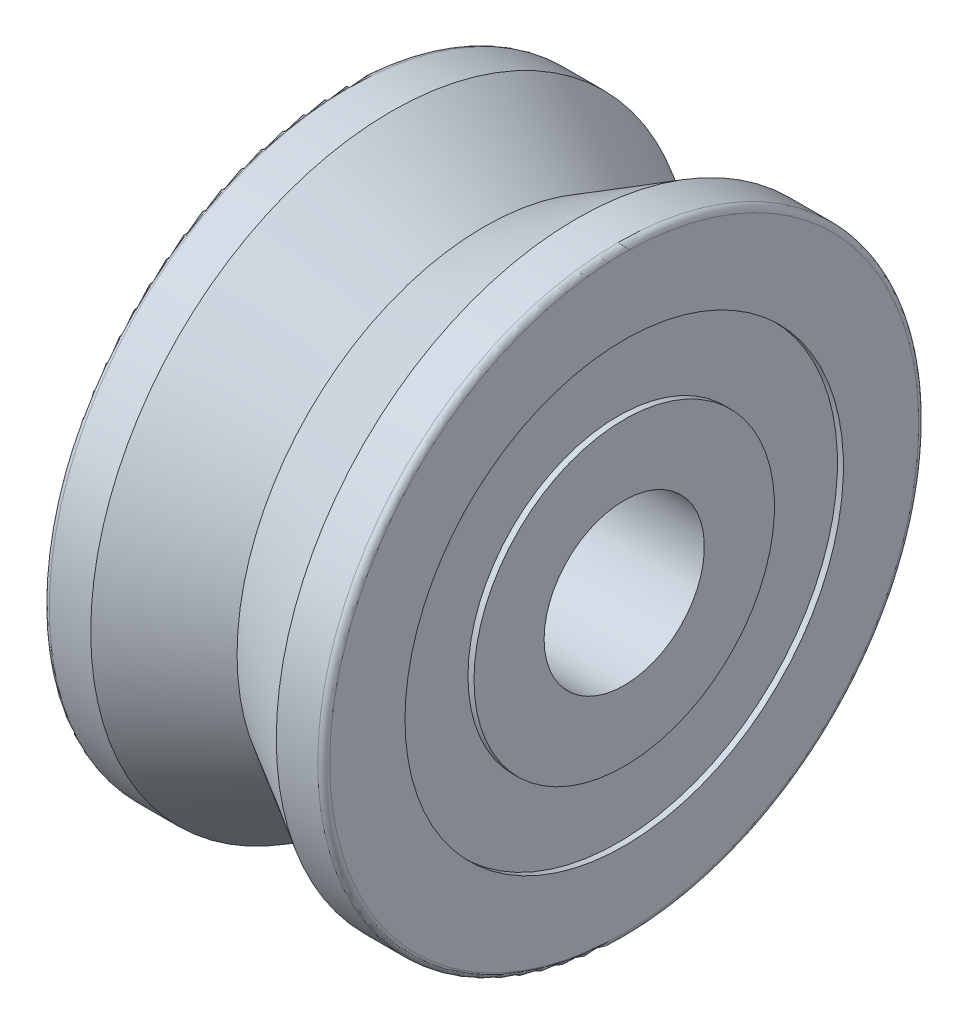
ISO-10303-21;
HEADER;
FILE_DESCRIPTION(('STEP AP214'),'2;1');
FILE_NAME('part.step','',(''),(''),'','','');
FILE_SCHEMA(('AUTOMOTIVE_DESIGN { 1 0 10303 214 1 1 1 1 }'));
ENDSEC;
DATA;
#1=APPLICATION_CONTEXT('core data for automotive mechanical design processes');
#2=APPLICATION_PROTOCOL_DEFINITION('international standard','automotive_design',2000,#1);
#3=PRODUCT_CONTEXT('',#1,'mechanical');
#4=PRODUCT('Part','Part','',(#3));
#5=PRODUCT_RELATED_PRODUCT_CATEGORY('part','',(#4));
#6=PRODUCT_DEFINITION_FORMATION('','',#4);
#7=PRODUCT_DEFINITION_CONTEXT('part definition',#1,'design');
#8=PRODUCT_DEFINITION('design','',#6,#7);
#9=PRODUCT_DEFINITION_SHAPE('','',#8);
#10=(LENGTH_UNIT() NAMED_UNIT(*) SI_UNIT(.MILLI.,.METRE.));
#11=(NAMED_UNIT(*) PLANE_ANGLE_UNIT() SI_UNIT($,.RADIAN.));
#12=(NAMED_UNIT(*) SI_UNIT($,.STERADIAN.) SOLID_ANGLE_UNIT());
#13=UNCERTAINTY_MEASURE_WITH_UNIT(LENGTH_MEASURE(1.E-05),#10,'distance_accuracy_value','');
#14=(GEOMETRIC_REPRESENTATION_CONTEXT(3) GLOBAL_UNCERTAINTY_ASSIGNED_CONTEXT((#13)) GLOBAL_UNIT_ASSIGNED_CONTEXT((#10,
#11,#12)) REPRESENTATION_CONTEXT('',''));
#15=CARTESIAN_POINT('',(0.,0.,0.));
#16=DIRECTION('',(0.,0.,1.));
#17=DIRECTION('',(1.,0.,0.));
#18=AXIS2_PLACEMENT_3D('',#15,#16,#17);
#19=CARTESIAN_POINT('',(0.3,0.,0.));
#20=DIRECTION('',(-1.,0.,0.));
#21=DIRECTION('',(0.,0.,1.));
#22=AXIS2_PLACEMENT_3D('',#19,#20,#21);
#23=TOROIDAL_SURFACE('',#22,14.7,0.3);
#24=CARTESIAN_POINT('',(0.300000000000002,0.,0.));
#25=DIRECTION('',(-1.,0.,0.));
#26=DIRECTION('',(0.,0.,1.));
#27=AXIS2_PLACEMENT_3D('',#24,#25,#26);
#28=CIRCLE('',#27,15.);
#29=CARTESIAN_POINT('',(0.300000000000002,0.,15.));
#30=VERTEX_POINT('',#29);
#31=EDGE_CURVE('E95',#30,#30,#28,.T.);
#32=ORIENTED_EDGE('',*,*,#31,.T.);
#33=EDGE_LOOP('',(#32));
#34=FACE_BOUND('',#33,.T.);
#35=CARTESIAN_POINT('',(0.,0.,0.));
#36=DIRECTION('',(-1.,0.,0.));
#37=DIRECTION('',(0.,0.,1.));
#38=AXIS2_PLACEMENT_3D('',#35,#36,#37);
#39=CIRCLE('',#38,14.7);
#40=CARTESIAN_POINT('',(0.,0.,14.7));
#41=VERTEX_POINT('',#40);
#42=EDGE_CURVE('E10',#41,#41,#39,.T.);
#43=ORIENTED_EDGE('',*,*,#42,.F.);
#44=EDGE_LOOP('',(#43));
#45=FACE_BOUND('',#44,.T.);
#46=ADVANCED_FACE('F40',(#34,#45),#23,.T.);
#47=CARTESIAN_POINT('',(0.,0.,0.));
#48=DIRECTION('',(-1.,0.,0.));
#49=DIRECTION('',(0.,0.,1.));
#50=AXIS2_PLACEMENT_3D('',#47,#48,#49);
#51=PLANE('',#50);
#52=ORIENTED_EDGE('',*,*,#42,.T.);
#53=EDGE_LOOP('',(#52));
#54=FACE_BOUND('',#53,.T.);
#55=CARTESIAN_POINT('',(0.,0.,0.));
#56=DIRECTION('',(-1.,0.,0.));
#57=DIRECTION('',(0.,0.,1.));
#58=AXIS2_PLACEMENT_3D('',#55,#56,#57);
#59=CIRCLE('',#58,10.9429396331011);
#60=CARTESIAN_POINT('',(0.,0.,10.9429396331011));
#61=VERTEX_POINT('',#60);
#62=EDGE_CURVE('E46',#61,#61,#59,.T.);
#63=ORIENTED_EDGE('',*,*,#62,.F.);
#64=EDGE_LOOP('',(#63));
#65=FACE_BOUND('',#64,.T.);
#66=ADVANCED_FACE('F117',(#54,#65),#51,.T.);
#67=CARTESIAN_POINT('',(0.300000000000002,0.,0.));
#68=DIRECTION('',(-1.,0.,0.));
#69=DIRECTION('',(0.,0.,1.));
#70=AXIS2_PLACEMENT_3D('',#67,#68,#69);
#71=CYLINDRICAL_SURFACE('',#70,10.9429396331011);
#72=ORIENTED_EDGE('',*,*,#62,.T.);
#73=EDGE_LOOP('',(#72));
#74=FACE_BOUND('',#73,.T.);
#75=CARTESIAN_POINT('',(0.3,0.,0.));
#76=DIRECTION('',(-1.,0.,0.));
#77=DIRECTION('',(0.,0.,1.));
#78=AXIS2_PLACEMENT_3D('',#75,#76,#77);
#79=CIRCLE('',#78,10.9429396331011);
#80=CARTESIAN_POINT('',(0.3,0.,10.9429396331011));
#81=VERTEX_POINT('',#80);
#82=EDGE_CURVE('E50',#81,#81,#79,.T.);
#83=ORIENTED_EDGE('',*,*,#82,.F.);
#84=EDGE_LOOP('',(#83));
#85=FACE_BOUND('',#84,.T.);
#86=ADVANCED_FACE('F121',(#74,#85),#71,.F.);
#87=CARTESIAN_POINT('',(0.3,0.,0.));
#88=DIRECTION('',(1.,0.,0.));
#89=DIRECTION('',(0.,0.,-1.));
#90=AXIS2_PLACEMENT_3D('',#87,#88,#89);
#91=PLANE('',#90);
#92=CARTESIAN_POINT('',(0.3,0.,0.));
#93=DIRECTION('',(-1.,0.,0.));
#94=DIRECTION('',(0.,0.,1.));
#95=AXIS2_PLACEMENT_3D('',#92,#93,#94);
#96=CIRCLE('',#95,7.5);
#97=CARTESIAN_POINT('',(0.3,0.,7.5));
#98=VERTEX_POINT('',#97);
#99=EDGE_CURVE('E54',#98,#98,#96,.T.);
#100=ORIENTED_EDGE('',*,*,#99,.F.);
#101=EDGE_LOOP('',(#100));
#102=FACE_BOUND('',#101,.T.);
#103=ORIENTED_EDGE('',*,*,#82,.T.);
#104=EDGE_LOOP('',(#103));
#105=FACE_BOUND('',#104,.T.);
#106=ADVANCED_FACE('F127',(#102,#105),#91,.F.);
#107=CARTESIAN_POINT('',(0.300000000000002,0.,0.));
#108=DIRECTION('',(-1.,0.,0.));
#109=DIRECTION('',(0.,0.,1.));
#110=AXIS2_PLACEMENT_3D('',#107,#108,#109);
#111=CYLINDRICAL_SURFACE('',#110,7.5);
#112=CARTESIAN_POINT('',(0.,0.,0.));
#113=DIRECTION('',(-1.,0.,0.));
#114=DIRECTION('',(0.,0.,1.));
#115=AXIS2_PLACEMENT_3D('',#112,#113,#114);
#116=CIRCLE('',#115,7.5);
#117=CARTESIAN_POINT('',(0.,0.,7.5));
#118=VERTEX_POINT('',#117);
#119=EDGE_CURVE('E59',#118,#118,#116,.T.);
#120=ORIENTED_EDGE('',*,*,#119,.F.);
#121=EDGE_LOOP('',(#120));
#122=FACE_BOUND('',#121,.T.);
#123=ORIENTED_EDGE('',*,*,#99,.T.);
#124=EDGE_LOOP('',(#123));
#125=FACE_BOUND('',#124,.T.);
#126=ADVANCED_FACE('F133',(#122,#125),#111,.T.);
#127=ORIENTED_EDGE('',*,*,#119,.T.);
#128=EDGE_LOOP('',(#127));
#129=FACE_BOUND('',#128,.T.);
#130=CARTESIAN_POINT('',(0.,0.,0.));
#131=DIRECTION('',(-1.,0.,0.));
#132=DIRECTION('',(0.,0.,1.));
#133=AXIS2_PLACEMENT_3D('',#130,#131,#132);
#134=CIRCLE('',#133,4.);
#135=CARTESIAN_POINT('',(0.,0.,4.));
#136=VERTEX_POINT('',#135);
#137=EDGE_CURVE('E62',#136,#136,#134,.T.);
#138=ORIENTED_EDGE('',*,*,#137,.F.);
#139=EDGE_LOOP('',(#138));
#140=FACE_BOUND('',#139,.T.);
#141=ADVANCED_FACE('F123',(#129,#140),#51,.T.);
#142=CARTESIAN_POINT('',(0.300000000000002,0.,0.));
#143=DIRECTION('',(-1.,0.,0.));
#144=DIRECTION('',(0.,0.,1.));
#145=AXIS2_PLACEMENT_3D('',#142,#143,#144);
#146=CYLINDRICAL_SURFACE('',#145,4.);
#147=CARTESIAN_POINT('',(14.,0.,0.));
#148=DIRECTION('',(-1.,0.,0.));
#149=DIRECTION('',(0.,0.,1.));
#150=AXIS2_PLACEMENT_3D('',#147,#148,#149);
#151=CIRCLE('',#150,4.);
#152=CARTESIAN_POINT('',(14.,0.,4.));
#153=VERTEX_POINT('',#152);
#154=EDGE_CURVE('E65',#153,#153,#151,.T.);
#155=ORIENTED_EDGE('',*,*,#154,.F.);
#156=EDGE_LOOP('',(#155));
#157=FACE_BOUND('',#156,.T.);
#158=ORIENTED_EDGE('',*,*,#137,.T.);
#159=EDGE_LOOP('',(#158));
#160=FACE_BOUND('',#159,.T.);
#161=ADVANCED_FACE('F132',(#157,#160),#146,.F.);
#162=CARTESIAN_POINT('',(14.,0.,0.));
#163=DIRECTION('',(-1.,0.,0.));
#164=DIRECTION('',(0.,0.,1.));
#165=AXIS2_PLACEMENT_3D('',#162,#163,#164);
#166=PLANE('',#165);
#167=CARTESIAN_POINT('',(14.,0.,0.));
#168=DIRECTION('',(-1.,0.,0.));
#169=DIRECTION('',(0.,0.,1.));
#170=AXIS2_PLACEMENT_3D('',#167,#168,#169);
#171=CIRCLE('',#170,7.5);
#172=CARTESIAN_POINT('',(14.,0.,7.5));
#173=VERTEX_POINT('',#172);
#174=EDGE_CURVE('E68',#173,#173,#171,.T.);
#175=ORIENTED_EDGE('',*,*,#174,.F.);
#176=EDGE_LOOP('',(#175));
#177=FACE_BOUND('',#176,.T.);
#178=ORIENTED_EDGE('',*,*,#154,.T.);
#179=EDGE_LOOP('',(#178));
#180=FACE_BOUND('',#179,.T.);
#181=ADVANCED_FACE('F139',(#177,#180),#166,.F.);
#182=CARTESIAN_POINT('',(0.300000000000002,0.,0.));
#183=DIRECTION('',(-1.,0.,0.));
#184=DIRECTION('',(0.,0.,1.));
#185=AXIS2_PLACEMENT_3D('',#182,#183,#184);
#186=CYLINDRICAL_SURFACE('',#185,7.5);
#187=ORIENTED_EDGE('',*,*,#174,.T.);
#188=EDGE_LOOP('',(#187));
#189=FACE_BOUND('',#188,.T.);
#190=CARTESIAN_POINT('',(13.7,0.,0.));
#191=DIRECTION('',(-1.,0.,0.));
#192=DIRECTION('',(0.,0.,1.));
#193=AXIS2_PLACEMENT_3D('',#190,#191,#192);
#194=CIRCLE('',#193,7.5);
#195=CARTESIAN_POINT('',(13.7,0.,7.5));
#196=VERTEX_POINT('',#195);
#197=EDGE_CURVE('E71',#196,#196,#194,.T.);
#198=ORIENTED_EDGE('',*,*,#197,.F.);
#199=EDGE_LOOP('',(#198));
#200=FACE_BOUND('',#199,.T.);
#201=ADVANCED_FACE('F185',(#189,#200),#186,.T.);
#202=CARTESIAN_POINT('',(13.7,0.,0.));
#203=DIRECTION('',(1.,0.,0.));
#204=DIRECTION('',(0.,0.,-1.));
#205=AXIS2_PLACEMENT_3D('',#202,#203,#204);
#206=PLANE('',#205);
#207=ORIENTED_EDGE('',*,*,#197,.T.);
#208=EDGE_LOOP('',(#207));
#209=FACE_BOUND('',#208,.T.);
#210=CARTESIAN_POINT('',(13.7,0.,0.));
#211=DIRECTION('',(-1.,0.,0.));
#212=DIRECTION('',(0.,0.,1.));
#213=AXIS2_PLACEMENT_3D('',#210,#211,#212);
#214=CIRCLE('',#213,10.9429396331011);
#215=CARTESIAN_POINT('',(13.7,0.,10.9429396331011));
#216=VERTEX_POINT('',#215);
#217=EDGE_CURVE('E74',#216,#216,#214,.T.);
#218=ORIENTED_EDGE('',*,*,#217,.F.);
#219=EDGE_LOOP('',(#218));
#220=FACE_BOUND('',#219,.T.);
#221=ADVANCED_FACE('F196',(#209,#220),#206,.T.);
#222=CARTESIAN_POINT('',(0.300000000000002,0.,0.));
#223=DIRECTION('',(-1.,0.,0.));
#224=DIRECTION('',(0.,0.,1.));
#225=AXIS2_PLACEMENT_3D('',#222,#223,#224);
#226=CYLINDRICAL_SURFACE('',#225,10.9429396331011);
#227=CARTESIAN_POINT('',(14.,0.,0.));
#228=DIRECTION('',(-1.,0.,0.));
#229=DIRECTION('',(0.,0.,1.));
#230=AXIS2_PLACEMENT_3D('',#227,#228,#229);
#231=CIRCLE('',#230,10.9429396331011);
#232=CARTESIAN_POINT('',(14.,0.,10.9429396331011));
#233=VERTEX_POINT('',#232);
#234=EDGE_CURVE('E77',#233,#233,#231,.T.);
#235=ORIENTED_EDGE('',*,*,#234,.F.);
#236=EDGE_LOOP('',(#235));
#237=FACE_BOUND('',#236,.T.);
#238=ORIENTED_EDGE('',*,*,#217,.T.);
#239=EDGE_LOOP('',(#238));
#240=FACE_BOUND('',#239,.T.);
#241=ADVANCED_FACE('F206',(#237,#240),#226,.F.);
#242=CARTESIAN_POINT('',(14.,0.,0.));
#243=DIRECTION('',(-1.,0.,0.));
#244=DIRECTION('',(0.,0.,1.));
#245=AXIS2_PLACEMENT_3D('',#242,#243,#244);
#246=CIRCLE('',#245,14.7);
#247=CARTESIAN_POINT('',(14.,0.,14.7));
#248=VERTEX_POINT('',#247);
#249=EDGE_CURVE('E80',#248,#248,#246,.T.);
#250=ORIENTED_EDGE('',*,*,#249,.F.);
#251=EDGE_LOOP('',(#250));
#252=FACE_BOUND('',#251,.T.);
#253=ORIENTED_EDGE('',*,*,#234,.T.);
#254=EDGE_LOOP('',(#253));
#255=FACE_BOUND('',#254,.T.);
#256=ADVANCED_FACE('F188',(#252,#255),#166,.F.);
#257=CARTESIAN_POINT('',(13.7,0.,0.));
#258=DIRECTION('',(-1.,0.,0.));
#259=DIRECTION('',(0.,0.,1.));
#260=AXIS2_PLACEMENT_3D('',#257,#258,#259);
#261=TOROIDAL_SURFACE('',#260,14.7,0.3);
#262=ORIENTED_EDGE('',*,*,#249,.T.);
#263=EDGE_LOOP('',(#262));
#264=FACE_BOUND('',#263,.T.);
#265=CARTESIAN_POINT('',(13.7,0.,0.));
#266=DIRECTION('',(-1.,0.,0.));
#267=DIRECTION('',(0.,0.,1.));
#268=AXIS2_PLACEMENT_3D('',#265,#266,#267);
#269=CIRCLE('',#268,15.);
#270=CARTESIAN_POINT('',(13.7,0.,15.));
#271=VERTEX_POINT('',#270);
#272=EDGE_CURVE('E83',#271,#271,#269,.T.);
#273=ORIENTED_EDGE('',*,*,#272,.F.);
#274=EDGE_LOOP('',(#273));
#275=FACE_BOUND('',#274,.T.);
#276=ADVANCED_FACE('F114',(#264,#275),#261,.T.);
#277=CARTESIAN_POINT('',(0.300000000000002,0.,0.));
#278=DIRECTION('',(-1.,0.,0.));
#279=DIRECTION('',(0.,0.,1.));
#280=AXIS2_PLACEMENT_3D('',#277,#278,#279);
#281=CYLINDRICAL_SURFACE('',#280,15.);
#282=ORIENTED_EDGE('',*,*,#272,.T.);
#283=EDGE_LOOP('',(#282));
#284=FACE_BOUND('',#283,.T.);
#285=CARTESIAN_POINT('',(11.6306424965365,0.,0.));
#286=DIRECTION('',(-1.,0.,0.));
#287=DIRECTION('',(0.,0.,1.));
#288=AXIS2_PLACEMENT_3D('',#285,#286,#287);
#289=CIRCLE('',#288,15.);
#290=CARTESIAN_POINT('',(11.6306424965365,0.,15.));
#291=VERTEX_POINT('',#290);
#292=EDGE_CURVE('E86',#291,#291,#289,.T.);
#293=ORIENTED_EDGE('',*,*,#292,.F.);
#294=EDGE_LOOP('',(#293));
#295=FACE_BOUND('',#294,.T.);
#296=ADVANCED_FACE('F106',(#284,#295),#281,.T.);
#297=CARTESIAN_POINT('',(7.,0.,0.));
#298=DIRECTION('',(1.,0.,0.));
#299=DIRECTION('',(0.,0.,-1.));
#300=AXIS2_PLACEMENT_3D('',#297,#298,#299);
#301=CONICAL_SURFACE('',#300,12.3264973081037,0.523598775598293);
#302=ORIENTED_EDGE('',*,*,#292,.T.);
#303=EDGE_LOOP('',(#302));
#304=FACE_BOUND('',#303,.T.);
#305=CARTESIAN_POINT('',(7.,0.,0.));
#306=DIRECTION('',(-1.,0.,0.));
#307=DIRECTION('',(0.,0.,1.));
#308=AXIS2_PLACEMENT_3D('',#305,#306,#307);
#309=CIRCLE('',#308,12.3264973081037);
#310=CARTESIAN_POINT('',(7.,0.,12.3264973081037));
#311=VERTEX_POINT('',#310);
#312=EDGE_CURVE('E89',#311,#311,#309,.T.);
#313=ORIENTED_EDGE('',*,*,#312,.F.);
#314=EDGE_LOOP('',(#313));
#315=FACE_BOUND('',#314,.T.);
#316=ADVANCED_FACE('F110',(#304,#315),#301,.T.);
#317=CARTESIAN_POINT('',(7.,0.,0.));
#318=DIRECTION('',(-1.,0.,0.));
#319=DIRECTION('',(0.,0.,1.));
#320=AXIS2_PLACEMENT_3D('',#317,#318,#319);
#321=CONICAL_SURFACE('',#320,12.3264973081037,0.523598775598297);
#322=CARTESIAN_POINT('',(2.36935750346351,0.,0.));
#323=DIRECTION('',(-1.,0.,0.));
#324=DIRECTION('',(0.,0.,1.));
#325=AXIS2_PLACEMENT_3D('',#322,#323,#324);
#326=CIRCLE('',#325,15.);
#327=CARTESIAN_POINT('',(2.36935750346351,0.,15.));
#328=VERTEX_POINT('',#327);
#329=EDGE_CURVE('E92',#328,#328,#326,.T.);
#330=ORIENTED_EDGE('',*,*,#329,.F.);
#331=EDGE_LOOP('',(#330));
#332=FACE_BOUND('',#331,.T.);
#333=ORIENTED_EDGE('',*,*,#312,.T.);
#334=EDGE_LOOP('',(#333));
#335=FACE_BOUND('',#334,.T.);
#336=ADVANCED_FACE('F103',(#332,#335),#321,.T.);
#337=ORIENTED_EDGE('',*,*,#329,.T.);
#338=EDGE_LOOP('',(#337));
#339=FACE_BOUND('',#338,.T.);
#340=ORIENTED_EDGE('',*,*,#31,.F.);
#341=EDGE_LOOP('',(#340));
#342=FACE_BOUND('',#341,.T.);
#343=ADVANCED_FACE('F101',(#339,#342),#281,.T.);
#344=CLOSED_SHELL('',(#46,#66,#86,#106,#126,#141,#161,#181,#201,#221,#241,#256,#276,#296,#316,
#336,#343));
#345=MANIFOLD_SOLID_BREP('B2',#344);
#346=ADVANCED_BREP_SHAPE_REPRESENTATION('',(#18,#345),#14);
#347=SHAPE_DEFINITION_REPRESENTATION(#9,#346);
ENDSEC;
END-ISO-10303-21;
